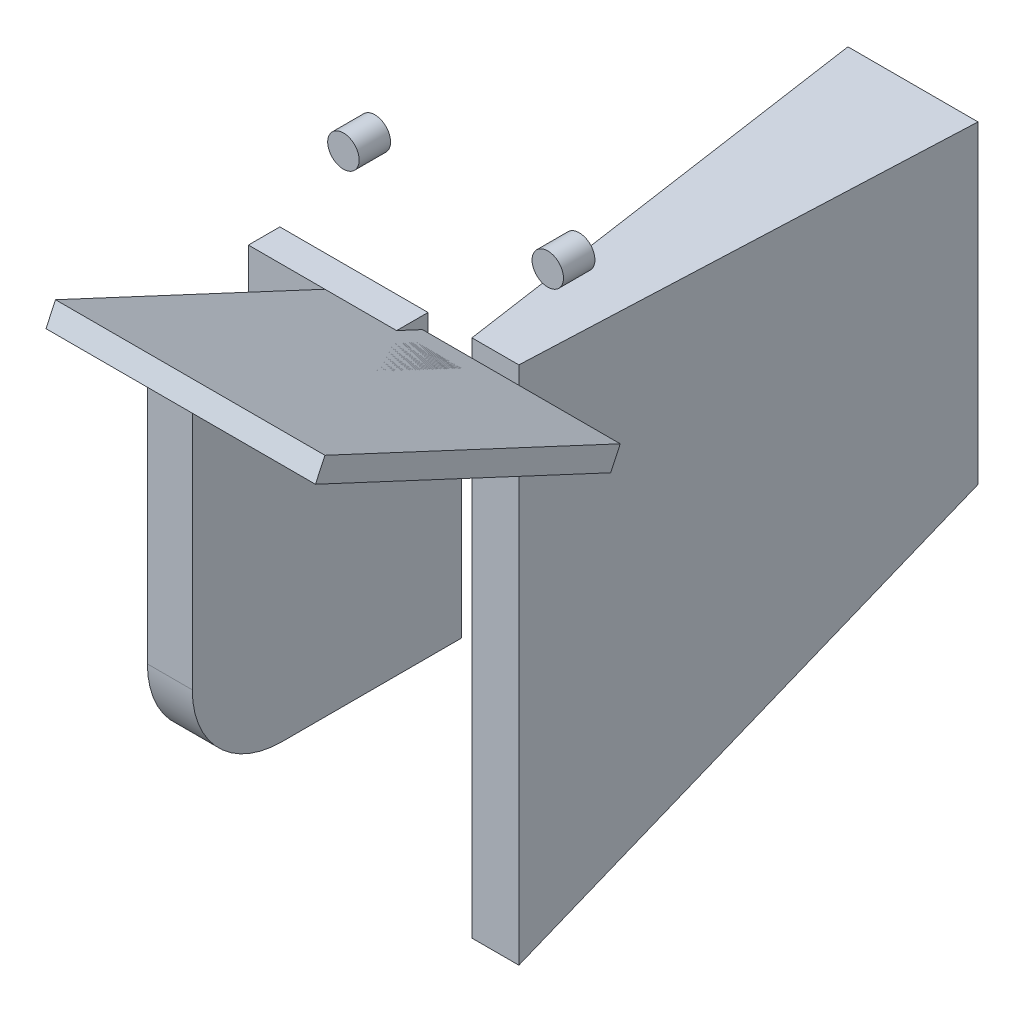
ISO-10303-21;
HEADER;
FILE_DESCRIPTION(('STEP AP214'),'2;1');
FILE_NAME('part.step','',(''),(''),'','','');
FILE_SCHEMA(('AUTOMOTIVE_DESIGN { 1 0 10303 214 1 1 1 1 }'));
ENDSEC;
DATA;
#1=APPLICATION_CONTEXT('core data for automotive mechanical design processes');
#2=APPLICATION_PROTOCOL_DEFINITION('international standard','automotive_design',2000,#1);
#3=PRODUCT_CONTEXT('',#1,'mechanical');
#4=PRODUCT('Part','Part','',(#3));
#5=PRODUCT_RELATED_PRODUCT_CATEGORY('part','',(#4));
#6=PRODUCT_DEFINITION_FORMATION('','',#4);
#7=PRODUCT_DEFINITION_CONTEXT('part definition',#1,'design');
#8=PRODUCT_DEFINITION('design','',#6,#7);
#9=PRODUCT_DEFINITION_SHAPE('','',#8);
#10=(LENGTH_UNIT() NAMED_UNIT(*) SI_UNIT(.MILLI.,.METRE.));
#11=(NAMED_UNIT(*) PLANE_ANGLE_UNIT() SI_UNIT($,.RADIAN.));
#12=(NAMED_UNIT(*) SI_UNIT($,.STERADIAN.) SOLID_ANGLE_UNIT());
#13=UNCERTAINTY_MEASURE_WITH_UNIT(LENGTH_MEASURE(1.E-05),#10,'distance_accuracy_value','');
#14=(GEOMETRIC_REPRESENTATION_CONTEXT(3) GLOBAL_UNCERTAINTY_ASSIGNED_CONTEXT((#13)) GLOBAL_UNIT_ASSIGNED_CONTEXT((#10,
#11,#12)) REPRESENTATION_CONTEXT('',''));
#15=CARTESIAN_POINT('',(0.,0.,0.));
#16=DIRECTION('',(0.,0.,1.));
#17=DIRECTION('',(1.,0.,0.));
#18=AXIS2_PLACEMENT_3D('',#15,#16,#17);
#19=CARTESIAN_POINT('',(29.5000000004554,6.49544339756053,7.));
#20=DIRECTION('',(0.,0.,1.));
#21=DIRECTION('',(0.,-1.,0.));
#22=AXIS2_PLACEMENT_3D('',#19,#20,#21);
#23=PLANE('',#22);
#24=DIRECTION('',(0.,-1.,0.));
#25=VECTOR('',#24,1.);
#26=CARTESIAN_POINT('',(39.5000000004554,6.49544339756053,7.));
#27=LINE('',#26,#25);
#28=CARTESIAN_POINT('',(39.5000000004554,6.49544339756053,7.));
#29=VERTEX_POINT('',#28);
#30=CARTESIAN_POINT('',(39.5000000004554,-45.5260971131392,7.));
#31=VERTEX_POINT('',#30);
#32=EDGE_CURVE('E114',#29,#31,#27,.T.);
#33=ORIENTED_EDGE('',*,*,#32,.T.);
#34=DIRECTION('',(1.,0.,0.));
#35=VECTOR('',#34,1.);
#36=CARTESIAN_POINT('',(29.5000000004554,-45.5260971131392,7.));
#37=LINE('',#36,#35);
#38=CARTESIAN_POINT('',(29.5000000004554,-45.5260971131392,7.));
#39=VERTEX_POINT('',#38);
#40=EDGE_CURVE('E97',#39,#31,#37,.T.);
#41=ORIENTED_EDGE('',*,*,#40,.F.);
#42=DIRECTION('',(0.,-1.,0.));
#43=VECTOR('',#42,1.);
#44=CARTESIAN_POINT('',(29.5000000004554,6.49544339756053,7.));
#45=LINE('',#44,#43);
#46=CARTESIAN_POINT('',(29.5000000004554,6.49544339756053,7.));
#47=VERTEX_POINT('',#46);
#48=EDGE_CURVE('E102',#47,#39,#45,.T.);
#49=ORIENTED_EDGE('',*,*,#48,.F.);
#50=DIRECTION('',(1.,0.,0.));
#51=VECTOR('',#50,1.);
#52=CARTESIAN_POINT('',(29.5000000004554,6.49544339756053,7.));
#53=LINE('',#52,#51);
#54=EDGE_CURVE('E121',#47,#29,#53,.T.);
#55=ORIENTED_EDGE('',*,*,#54,.T.);
#56=EDGE_LOOP('',(#33,#41,#49,#55));
#57=FACE_BOUND('',#56,.T.);
#58=ADVANCED_FACE('F50',(#57),#23,.F.);
#59=CARTESIAN_POINT('',(29.5000000004554,-45.5260971131392,67.));
#60=DIRECTION('',(0.,1.,0.));
#61=DIRECTION('',(0.,0.,1.));
#62=AXIS2_PLACEMENT_3D('',#59,#60,#61);
#63=PLANE('',#62);
#64=DIRECTION('',(0.,0.,1.));
#65=VECTOR('',#64,1.);
#66=CARTESIAN_POINT('',(39.5000000004554,-45.5260971131392,67.));
#67=LINE('',#66,#65);
#68=CARTESIAN_POINT('',(39.5000000004554,-45.5260971131392,47.));
#69=VERTEX_POINT('',#68);
#70=EDGE_CURVE('E129',#31,#69,#67,.T.);
#71=ORIENTED_EDGE('',*,*,#70,.T.);
#72=DIRECTION('',(1.,0.,0.));
#73=VECTOR('',#72,1.);
#74=CARTESIAN_POINT('',(29.5000000004554,-45.5260971131392,47.));
#75=LINE('',#74,#73);
#76=CARTESIAN_POINT('',(29.5000000004554,-45.5260971131392,47.));
#77=VERTEX_POINT('',#76);
#78=EDGE_CURVE('E58',#69,#77,#75,.F.);
#79=ORIENTED_EDGE('',*,*,#78,.T.);
#80=DIRECTION('',(0.,0.,1.));
#81=VECTOR('',#80,1.);
#82=CARTESIAN_POINT('',(29.5000000004554,-45.5260971131392,67.));
#83=LINE('',#82,#81);
#84=EDGE_CURVE('E93',#39,#77,#83,.T.);
#85=ORIENTED_EDGE('',*,*,#84,.F.);
#86=ORIENTED_EDGE('',*,*,#40,.T.);
#87=EDGE_LOOP('',(#71,#79,#85,#86));
#88=FACE_BOUND('',#87,.T.);
#89=ADVANCED_FACE('F95',(#88),#63,.F.);
#90=CARTESIAN_POINT('',(29.5000000004554,34.4739028868608,67.));
#91=DIRECTION('',(0.,0.,-1.));
#92=DIRECTION('',(0.,1.,0.));
#93=AXIS2_PLACEMENT_3D('',#90,#91,#92);
#94=PLANE('',#93);
#95=DIRECTION('',(0.,1.,0.));
#96=VECTOR('',#95,1.);
#97=CARTESIAN_POINT('',(29.5000000004554,34.4739028868608,67.));
#98=LINE('',#97,#96);
#99=CARTESIAN_POINT('',(29.5000000004554,-25.5260971131392,67.));
#100=VERTEX_POINT('',#99);
#101=CARTESIAN_POINT('',(29.5000000004554,34.4739028868608,67.));
#102=VERTEX_POINT('',#101);
#103=EDGE_CURVE('E101',#100,#102,#98,.T.);
#104=ORIENTED_EDGE('',*,*,#103,.F.);
#105=DIRECTION('',(1.,0.,0.));
#106=VECTOR('',#105,1.);
#107=CARTESIAN_POINT('',(29.5000000004554,-25.5260971131392,67.));
#108=LINE('',#107,#106);
#109=CARTESIAN_POINT('',(39.5000000004554,-25.5260971131392,67.));
#110=VERTEX_POINT('',#109);
#111=EDGE_CURVE('E115',#100,#110,#108,.T.);
#112=ORIENTED_EDGE('',*,*,#111,.T.);
#113=DIRECTION('',(0.,1.,0.));
#114=VECTOR('',#113,1.);
#115=CARTESIAN_POINT('',(39.5000000004554,34.4739028868608,67.));
#116=LINE('',#115,#114);
#117=CARTESIAN_POINT('',(39.5000000004554,34.4739028868608,67.));
#118=VERTEX_POINT('',#117);
#119=EDGE_CURVE('E127',#110,#118,#116,.T.);
#120=ORIENTED_EDGE('',*,*,#119,.T.);
#121=DIRECTION('',(1.,0.,0.));
#122=VECTOR('',#121,1.);
#123=CARTESIAN_POINT('',(29.5000000004554,34.4739028868608,67.));
#124=LINE('',#123,#122);
#125=EDGE_CURVE('E116',#102,#118,#124,.T.);
#126=ORIENTED_EDGE('',*,*,#125,.F.);
#127=EDGE_LOOP('',(#104,#112,#120,#126));
#128=FACE_BOUND('',#127,.T.);
#129=ADVANCED_FACE('F137',(#128),#94,.F.);
#130=CARTESIAN_POINT('',(29.5000000004554,6.49544339756053,7.));
#131=DIRECTION('',(0.,-0.906307787036648,0.422618261740704));
#132=DIRECTION('',(0.,-0.422618261740704,-0.906307787036648));
#133=AXIS2_PLACEMENT_3D('',#130,#131,#132);
#134=PLANE('',#133);
#135=DIRECTION('',(0.,-0.422618261740704,-0.906307787036648));
#136=VECTOR('',#135,1.);
#137=CARTESIAN_POINT('',(39.5000000004554,6.49544339756053,7.));
#138=LINE('',#137,#136);
#139=EDGE_CURVE('E111',#118,#29,#138,.T.);
#140=ORIENTED_EDGE('',*,*,#139,.T.);
#141=ORIENTED_EDGE('',*,*,#54,.F.);
#142=DIRECTION('',(0.,-0.422618261740704,-0.906307787036648));
#143=VECTOR('',#142,1.);
#144=CARTESIAN_POINT('',(29.5000000004554,6.49544339756053,7.));
#145=LINE('',#144,#143);
#146=EDGE_CURVE('E107',#102,#47,#145,.T.);
#147=ORIENTED_EDGE('',*,*,#146,.F.);
#148=ORIENTED_EDGE('',*,*,#125,.T.);
#149=EDGE_LOOP('',(#140,#141,#147,#148));
#150=FACE_BOUND('',#149,.T.);
#151=ADVANCED_FACE('F140',(#150),#134,.F.);
#152=CARTESIAN_POINT('',(29.5000000004554,0.,0.));
#153=DIRECTION('',(1.,0.,0.));
#154=DIRECTION('',(0.,0.,-1.));
#155=AXIS2_PLACEMENT_3D('',#152,#153,#154);
#156=PLANE('',#155);
#157=ORIENTED_EDGE('',*,*,#84,.T.);
#158=CARTESIAN_POINT('',(29.5000000004554,-25.5260971131392,47.));
#159=DIRECTION('',(1.,0.,0.));
#160=DIRECTION('',(0.,0.,-1.));
#161=AXIS2_PLACEMENT_3D('',#158,#159,#160);
#162=CIRCLE('',#161,20.);
#163=EDGE_CURVE('E12',#77,#100,#162,.F.);
#164=ORIENTED_EDGE('',*,*,#163,.T.);
#165=ORIENTED_EDGE('',*,*,#103,.T.);
#166=ORIENTED_EDGE('',*,*,#146,.T.);
#167=ORIENTED_EDGE('',*,*,#48,.T.);
#168=EDGE_LOOP('',(#157,#164,#165,#166,#167));
#169=FACE_BOUND('',#168,.T.);
#170=ADVANCED_FACE('F105',(#169),#156,.F.);
#171=CARTESIAN_POINT('',(39.5000000004554,0.,0.));
#172=DIRECTION('',(1.,0.,0.));
#173=DIRECTION('',(0.,0.,-1.));
#174=AXIS2_PLACEMENT_3D('',#171,#172,#173);
#175=PLANE('',#174);
#176=ORIENTED_EDGE('',*,*,#119,.F.);
#177=CARTESIAN_POINT('',(39.5000000004554,-25.5260971131392,47.));
#178=DIRECTION('',(1.,0.,0.));
#179=DIRECTION('',(0.,0.,-1.));
#180=AXIS2_PLACEMENT_3D('',#177,#178,#179);
#181=CIRCLE('',#180,20.);
#182=EDGE_CURVE('E72',#110,#69,#181,.T.);
#183=ORIENTED_EDGE('',*,*,#182,.T.);
#184=ORIENTED_EDGE('',*,*,#70,.F.);
#185=ORIENTED_EDGE('',*,*,#32,.F.);
#186=ORIENTED_EDGE('',*,*,#139,.F.);
#187=EDGE_LOOP('',(#176,#183,#184,#185,#186));
#188=FACE_BOUND('',#187,.T.);
#189=ADVANCED_FACE('F141',(#188),#175,.T.);
#190=CARTESIAN_POINT('',(29.5000000004554,-25.5260971131392,47.));
#191=DIRECTION('',(1.,0.,0.));
#192=DIRECTION('',(0.,0.,-1.));
#193=AXIS2_PLACEMENT_3D('',#190,#191,#192);
#194=CYLINDRICAL_SURFACE('',#193,20.);
#195=ORIENTED_EDGE('',*,*,#163,.F.);
#196=ORIENTED_EDGE('',*,*,#78,.F.);
#197=ORIENTED_EDGE('',*,*,#182,.F.);
#198=ORIENTED_EDGE('',*,*,#111,.F.);
#199=EDGE_LOOP('',(#195,#196,#197,#198));
#200=FACE_BOUND('',#199,.T.);
#201=ADVANCED_FACE('F52',(#200),#194,.T.);
#202=CLOSED_SHELL('',(#58,#89,#129,#151,#170,#189,#201));
#203=MANIFOLD_SOLID_BREP('B2',#202);
#204=CARTESIAN_POINT('',(0.,-193.834238180492,-97.9796701991949));
#205=DIRECTION('',(0.,0.,1.));
#206=DIRECTION('',(1.,0.,0.));
#207=AXIS2_PLACEMENT_3D('',#204,#205,#206);
#208=PLANE('',#207);
#209=DIRECTION('',(0.,1.,0.));
#210=VECTOR('',#209,1.);
#211=CARTESIAN_POINT('',(49.4812615912494,-193.834238180492,-97.9796701991949));
#212=LINE('',#211,#210);
#213=CARTESIAN_POINT('',(49.4812615912494,-63.4225780339153,-97.9796701991949));
#214=VERTEX_POINT('',#213);
#215=CARTESIAN_POINT('',(49.4812615912494,6.49544339756053,-97.9796701991949));
#216=VERTEX_POINT('',#215);
#217=EDGE_CURVE('E284',#214,#216,#212,.T.);
#218=ORIENTED_EDGE('',*,*,#217,.F.);
#219=DIRECTION('',(-1.,0.,0.));
#220=VECTOR('',#219,1.);
#221=CARTESIAN_POINT('',(3.08269763028648E-13,-63.4225780339152,-97.9796701991949));
#222=LINE('',#221,#220);
#223=CARTESIAN_POINT('',(20.5187384096205,-63.4225780339152,-97.9796701991949));
#224=VERTEX_POINT('',#223);
#225=EDGE_CURVE('E229',#214,#224,#222,.T.);
#226=ORIENTED_EDGE('',*,*,#225,.T.);
#227=DIRECTION('',(0.,1.,0.));
#228=VECTOR('',#227,1.);
#229=CARTESIAN_POINT('',(20.5187384096205,-193.834238180492,-97.9796701991949));
#230=LINE('',#229,#228);
#231=CARTESIAN_POINT('',(20.5187384096205,6.49544339756053,-97.9796701991949));
#232=VERTEX_POINT('',#231);
#233=EDGE_CURVE('E259',#224,#232,#230,.T.);
#234=ORIENTED_EDGE('',*,*,#233,.T.);
#235=DIRECTION('',(1.,0.,0.));
#236=VECTOR('',#235,1.);
#237=CARTESIAN_POINT('',(0.,6.49544339756053,-97.9796701991949));
#238=LINE('',#237,#236);
#239=EDGE_CURVE('E262',#232,#216,#238,.T.);
#240=ORIENTED_EDGE('',*,*,#239,.T.);
#241=EDGE_LOOP('',(#218,#226,#234,#240));
#242=FACE_BOUND('',#241,.T.);
#243=ADVANCED_FACE('F222',(#242),#208,.F.);
#244=CARTESIAN_POINT('',(45.133983709623,-193.834238180492,1.96322086544044));
#245=DIRECTION('',(-0.999055318855758,0.,-0.0434565284625806));
#246=DIRECTION('',(-0.0434565284625806,0.,0.999055318855758));
#247=AXIS2_PLACEMENT_3D('',#244,#245,#246);
#248=PLANE('',#247);
#249=DIRECTION('',(0.,1.,0.));
#250=VECTOR('',#249,1.);
#251=CARTESIAN_POINT('',(45.2193791444974,-193.834238180492,0.));
#252=LINE('',#251,#250);
#253=CARTESIAN_POINT('',(45.2193791444974,-109.271615746902,0.));
#254=VERTEX_POINT('',#253);
#255=CARTESIAN_POINT('',(45.2193791444974,6.49544339756053,0.));
#256=VERTEX_POINT('',#255);
#257=EDGE_CURVE('E287',#254,#256,#252,.T.);
#258=ORIENTED_EDGE('',*,*,#257,.F.);
#259=DIRECTION('',(0.0393669572988325,0.423507014186949,-0.905037044328842));
#260=VECTOR('',#259,1.);
#261=CARTESIAN_POINT('',(43.7394566027982,-125.192520481939,34.0230694693485));
#262=LINE('',#261,#260);
#263=EDGE_CURVE('E236',#254,#214,#262,.T.);
#264=ORIENTED_EDGE('',*,*,#263,.T.);
#265=ORIENTED_EDGE('',*,*,#217,.T.);
#266=DIRECTION('',(-0.0434565284625806,0.,0.999055318855758));
#267=VECTOR('',#266,1.);
#268=CARTESIAN_POINT('',(45.133983709623,6.49544339756053,1.96322086544044));
#269=LINE('',#268,#267);
#270=EDGE_CURVE('E266',#216,#256,#269,.T.);
#271=ORIENTED_EDGE('',*,*,#270,.T.);
#272=EDGE_LOOP('',(#258,#264,#265,#271));
#273=FACE_BOUND('',#272,.T.);
#274=ADVANCED_FACE('F293',(#273),#248,.F.);
#275=CARTESIAN_POINT('',(0.,-193.834238180492,4.57744585818362E-13));
#276=DIRECTION('',(0.,0.,-1.));
#277=DIRECTION('',(-1.,0.,0.));
#278=AXIS2_PLACEMENT_3D('',#275,#276,#277);
#279=PLANE('',#278);
#280=DIRECTION('',(0.,1.,0.));
#281=VECTOR('',#280,1.);
#282=CARTESIAN_POINT('',(34.7806208555029,-193.834238180492,0.));
#283=LINE('',#282,#281);
#284=CARTESIAN_POINT('',(34.7806208555029,-109.271615746902,0.));
#285=VERTEX_POINT('',#284);
#286=CARTESIAN_POINT('',(34.7806208555029,6.49544339756053,0.));
#287=VERTEX_POINT('',#286);
#288=EDGE_CURVE('E265',#285,#287,#283,.T.);
#289=ORIENTED_EDGE('',*,*,#288,.F.);
#290=DIRECTION('',(1.,0.,0.));
#291=VECTOR('',#290,1.);
#292=CARTESIAN_POINT('',(-1.08585697845071E-13,-109.271615746902,4.57744585818363E-13));
#293=LINE('',#292,#291);
#294=EDGE_CURVE('E286',#285,#254,#293,.T.);
#295=ORIENTED_EDGE('',*,*,#294,.T.);
#296=ORIENTED_EDGE('',*,*,#257,.T.);
#297=DIRECTION('',(-1.,0.,0.));
#298=VECTOR('',#297,1.);
#299=CARTESIAN_POINT('',(0.,6.49544339756053,4.57744585818362E-13));
#300=LINE('',#299,#298);
#301=EDGE_CURVE('E278',#256,#287,#300,.T.);
#302=ORIENTED_EDGE('',*,*,#301,.T.);
#303=EDGE_LOOP('',(#289,#295,#296,#302));
#304=FACE_BOUND('',#303,.T.);
#305=ADVANCED_FACE('F291',(#304),#279,.F.);
#306=CARTESIAN_POINT('',(34.0589925564434,-193.834238180492,-4.95761362614967));
#307=DIRECTION('',(-0.989571624818279,0.,0.144041658399613));
#308=DIRECTION('',(0.144041658399613,0.,0.989571624818279));
#309=AXIS2_PLACEMENT_3D('',#306,#307,#308);
#310=PLANE('',#309);
#311=DIRECTION('',(-0.130707978099501,0.420199440011685,-0.897968738361758));
#312=VECTOR('',#311,1.);
#313=CARTESIAN_POINT('',(38.8308770719889,-122.292361831549,27.8254129368531));
#314=LINE('',#313,#312);
#315=EDGE_CURVE('E48',#285,#224,#314,.T.);
#316=ORIENTED_EDGE('',*,*,#315,.F.);
#317=ORIENTED_EDGE('',*,*,#288,.T.);
#318=DIRECTION('',(0.144041658399613,0.,0.989571624818279));
#319=VECTOR('',#318,1.);
#320=CARTESIAN_POINT('',(34.0589925564434,6.49544339756053,-4.95761362614967));
#321=LINE('',#320,#319);
#322=EDGE_CURVE('E272',#232,#287,#321,.T.);
#323=ORIENTED_EDGE('',*,*,#322,.F.);
#324=ORIENTED_EDGE('',*,*,#233,.F.);
#325=EDGE_LOOP('',(#316,#317,#323,#324));
#326=FACE_BOUND('',#325,.T.);
#327=ADVANCED_FACE('F275',(#326),#310,.T.);
#328=CARTESIAN_POINT('',(0.,6.49544339756053,0.));
#329=DIRECTION('',(0.,1.,0.));
#330=DIRECTION('',(0.,0.,1.));
#331=AXIS2_PLACEMENT_3D('',#328,#329,#330);
#332=PLANE('',#331);
#333=ORIENTED_EDGE('',*,*,#239,.F.);
#334=ORIENTED_EDGE('',*,*,#322,.T.);
#335=ORIENTED_EDGE('',*,*,#301,.F.);
#336=ORIENTED_EDGE('',*,*,#270,.F.);
#337=EDGE_LOOP('',(#333,#334,#335,#336));
#338=FACE_BOUND('',#337,.T.);
#339=ADVANCED_FACE('F270',(#338),#332,.T.);
#340=CARTESIAN_POINT('',(-4.99999999956517,16.5974489689036,-268.982950663816));
#341=DIRECTION('',(0.,0.905739154404806,0.423835562663241));
#342=DIRECTION('',(0.,-0.423835562663241,0.905739154404806));
#343=AXIS2_PLACEMENT_3D('',#340,#341,#342);
#344=PLANE('',#343);
#345=ORIENTED_EDGE('',*,*,#263,.F.);
#346=ORIENTED_EDGE('',*,*,#294,.F.);
#347=ORIENTED_EDGE('',*,*,#315,.T.);
#348=ORIENTED_EDGE('',*,*,#225,.F.);
#349=EDGE_LOOP('',(#345,#346,#347,#348));
#350=FACE_BOUND('',#349,.T.);
#351=ADVANCED_FACE('F309',(#350),#344,.F.);
#352=CLOSED_SHELL('',(#243,#274,#305,#327,#339,#351));
#353=MANIFOLD_SOLID_BREP('B6',#352);
#354=CARTESIAN_POINT('',(58.6604137531901,35.1985420606941,7.));
#355=DIRECTION('',(0.,0.,-1.));
#356=DIRECTION('',(-1.,0.,0.));
#357=AXIS2_PLACEMENT_3D('',#354,#355,#356);
#358=CYLINDRICAL_SURFACE('',#357,3.50000000000001);
#359=CARTESIAN_POINT('',(58.6604137531901,35.1985420606941,7.));
#360=DIRECTION('',(0.,0.,1.));
#361=DIRECTION('',(1.,0.,0.));
#362=AXIS2_PLACEMENT_3D('',#359,#360,#361);
#363=CIRCLE('',#362,3.50000000000001);
#364=CARTESIAN_POINT('',(62.1604137531902,35.1985420606941,7.));
#365=VERTEX_POINT('',#364);
#366=EDGE_CURVE('E373',#365,#365,#363,.T.);
#367=ORIENTED_EDGE('',*,*,#366,.F.);
#368=EDGE_LOOP('',(#367));
#369=FACE_BOUND('',#368,.T.);
#370=CARTESIAN_POINT('',(58.6604137531901,35.1985420606941,0.));
#371=DIRECTION('',(0.,0.,1.));
#372=DIRECTION('',(1.,0.,0.));
#373=AXIS2_PLACEMENT_3D('',#370,#371,#372);
#374=CIRCLE('',#373,3.50000000000001);
#375=CARTESIAN_POINT('',(62.1604137531902,35.1985420606941,0.));
#376=VERTEX_POINT('',#375);
#377=EDGE_CURVE('E221',#376,#376,#374,.T.);
#378=ORIENTED_EDGE('',*,*,#377,.T.);
#379=EDGE_LOOP('',(#378));
#380=FACE_BOUND('',#379,.T.);
#381=ADVANCED_FACE('F369',(#369,#380),#358,.T.);
#382=CARTESIAN_POINT('',(58.6604137531901,35.1985420606941,7.));
#383=DIRECTION('',(0.,0.,1.));
#384=DIRECTION('',(1.,0.,0.));
#385=AXIS2_PLACEMENT_3D('',#382,#383,#384);
#386=PLANE('',#385);
#387=ORIENTED_EDGE('',*,*,#366,.T.);
#388=EDGE_LOOP('',(#387));
#389=FACE_BOUND('',#388,.T.);
#390=ADVANCED_FACE('F371',(#389),#386,.T.);
#391=CARTESIAN_POINT('',(58.6604137531901,35.1985420606941,0.));
#392=DIRECTION('',(0.,0.,1.));
#393=DIRECTION('',(1.,0.,0.));
#394=AXIS2_PLACEMENT_3D('',#391,#392,#393);
#395=PLANE('',#394);
#396=ORIENTED_EDGE('',*,*,#377,.F.);
#397=EDGE_LOOP('',(#396));
#398=FACE_BOUND('',#397,.T.);
#399=ADVANCED_FACE('F388',(#398),#395,.F.);
#400=CLOSED_SHELL('',(#381,#390,#399));
#401=MANIFOLD_SOLID_BREP('B42',#400);
#402=CARTESIAN_POINT('',(13.1581918962194,35.1985420606941,7.));
#403=DIRECTION('',(0.,0.,-1.));
#404=DIRECTION('',(-1.,0.,0.));
#405=AXIS2_PLACEMENT_3D('',#402,#403,#404);
#406=CYLINDRICAL_SURFACE('',#405,3.5);
#407=CARTESIAN_POINT('',(13.1581918962194,35.1985420606941,7.));
#408=DIRECTION('',(0.,0.,1.));
#409=DIRECTION('',(1.,0.,0.));
#410=AXIS2_PLACEMENT_3D('',#407,#408,#409);
#411=CIRCLE('',#410,3.5);
#412=CARTESIAN_POINT('',(16.6581918962194,35.1985420606941,7.));
#413=VERTEX_POINT('',#412);
#414=EDGE_CURVE('E429',#413,#413,#411,.T.);
#415=ORIENTED_EDGE('',*,*,#414,.F.);
#416=EDGE_LOOP('',(#415));
#417=FACE_BOUND('',#416,.T.);
#418=CARTESIAN_POINT('',(13.1581918962194,35.1985420606941,0.));
#419=DIRECTION('',(0.,0.,1.));
#420=DIRECTION('',(1.,0.,0.));
#421=AXIS2_PLACEMENT_3D('',#418,#419,#420);
#422=CIRCLE('',#421,3.5);
#423=CARTESIAN_POINT('',(16.6581918962194,35.1985420606941,0.));
#424=VERTEX_POINT('',#423);
#425=EDGE_CURVE('E368',#424,#424,#422,.T.);
#426=ORIENTED_EDGE('',*,*,#425,.T.);
#427=EDGE_LOOP('',(#426));
#428=FACE_BOUND('',#427,.T.);
#429=ADVANCED_FACE('F425',(#417,#428),#406,.T.);
#430=CARTESIAN_POINT('',(13.1581918962194,35.1985420606941,7.));
#431=DIRECTION('',(0.,0.,1.));
#432=DIRECTION('',(1.,0.,0.));
#433=AXIS2_PLACEMENT_3D('',#430,#431,#432);
#434=PLANE('',#433);
#435=ORIENTED_EDGE('',*,*,#414,.T.);
#436=EDGE_LOOP('',(#435));
#437=FACE_BOUND('',#436,.T.);
#438=ADVANCED_FACE('F427',(#437),#434,.T.);
#439=CARTESIAN_POINT('',(13.1581918962194,35.1985420606941,0.));
#440=DIRECTION('',(0.,0.,1.));
#441=DIRECTION('',(1.,0.,0.));
#442=AXIS2_PLACEMENT_3D('',#439,#440,#441);
#443=PLANE('',#442);
#444=ORIENTED_EDGE('',*,*,#425,.F.);
#445=EDGE_LOOP('',(#444));
#446=FACE_BOUND('',#445,.T.);
#447=ADVANCED_FACE('F444',(#446),#443,.F.);
#448=CLOSED_SHELL('',(#429,#438,#447));
#449=MANIFOLD_SOLID_BREP('B216',#448);
#450=CARTESIAN_POINT('',(25.0000000004552,6.49544339756053,7.));
#451=DIRECTION('',(-1.,0.,0.));
#452=DIRECTION('',(0.,0.,1.));
#453=AXIS2_PLACEMENT_3D('',#450,#451,#452);
#454=PLANE('',#453);
#455=DIRECTION('',(0.,-0.422618261740704,-0.906307787036648));
#456=VECTOR('',#455,1.);
#457=CARTESIAN_POINT('',(25.0000000004552,1.96390446237729,9.11309130870352));
#458=LINE('',#457,#456);
#459=CARTESIAN_POINT('',(25.0000000004552,0.978553802748059,7.));
#460=VERTEX_POINT('',#459);
#461=CARTESIAN_POINT('',(25.0000000004552,-0.717251088539166,3.36333467480066));
#462=VERTEX_POINT('',#461);
#463=EDGE_CURVE('E584',#460,#462,#458,.T.);
#464=ORIENTED_EDGE('',*,*,#463,.F.);
#465=DIRECTION('',(0.,1.,0.));
#466=VECTOR('',#465,1.);
#467=CARTESIAN_POINT('',(25.0000000004552,6.49544339756053,7.));
#468=LINE('',#467,#466);
#469=CARTESIAN_POINT('',(25.0000000004552,-38.7915143226798,7.));
#470=VERTEX_POINT('',#469);
#471=EDGE_CURVE('E593',#470,#460,#468,.T.);
#472=ORIENTED_EDGE('',*,*,#471,.F.);
#473=DIRECTION('',(0.,0.,-1.));
#474=VECTOR('',#473,1.);
#475=CARTESIAN_POINT('',(25.0000000004552,-38.7915143226798,7.));
#476=LINE('',#475,#474);
#477=CARTESIAN_POINT('',(25.0000000004552,-38.7915143226798,0.));
#478=VERTEX_POINT('',#477);
#479=EDGE_CURVE('E613',#470,#478,#476,.T.);
#480=ORIENTED_EDGE('',*,*,#479,.T.);
#481=DIRECTION('',(0.,1.,0.));
#482=VECTOR('',#481,1.);
#483=CARTESIAN_POINT('',(25.0000000004552,6.49544339756053,0.));
#484=LINE('',#483,#482);
#485=CARTESIAN_POINT('',(25.0000000004552,6.49544339756053,0.));
#486=VERTEX_POINT('',#485);
#487=EDGE_CURVE('E605',#478,#486,#484,.T.);
#488=ORIENTED_EDGE('',*,*,#487,.T.);
#489=DIRECTION('',(0.,0.,-1.));
#490=VECTOR('',#489,1.);
#491=CARTESIAN_POINT('',(25.0000000004552,6.49544339756053,7.));
#492=LINE('',#491,#490);
#493=CARTESIAN_POINT('',(25.0000000004552,6.49544339756053,7.));
#494=VERTEX_POINT('',#493);
#495=EDGE_CURVE('E610',#494,#486,#492,.T.);
#496=ORIENTED_EDGE('',*,*,#495,.F.);
#497=DIRECTION('',(0.,-0.422618261740704,-0.906307787036648));
#498=VECTOR('',#497,1.);
#499=CARTESIAN_POINT('',(25.0000000004552,6.49544339756053,7.));
#500=LINE('',#499,#498);
#501=CARTESIAN_POINT('',(25.0000000004552,3.81428784664409,1.25024336609714));
#502=VERTEX_POINT('',#501);
#503=EDGE_CURVE('E490',#494,#502,#500,.T.);
#504=ORIENTED_EDGE('',*,*,#503,.T.);
#505=DIRECTION('',(0.,-0.906307787036648,0.422618261740704));
#506=VECTOR('',#505,1.);
#507=CARTESIAN_POINT('',(25.0000000004552,3.81428784664409,1.25024336609714));
#508=LINE('',#507,#506);
#509=EDGE_CURVE('E423',#502,#462,#508,.T.);
#510=ORIENTED_EDGE('',*,*,#509,.T.);
#511=EDGE_LOOP('',(#464,#472,#480,#488,#496,#504,#510));
#512=FACE_BOUND('',#511,.T.);
#513=ADVANCED_FACE('F472',(#512),#454,.F.);
#514=CARTESIAN_POINT('',(0.,0.,7.));
#515=DIRECTION('',(0.,0.,1.));
#516=DIRECTION('',(1.,0.,0.));
#517=AXIS2_PLACEMENT_3D('',#514,#515,#516);
#518=PLANE('',#517);
#519=DIRECTION('',(-1.,0.,0.));
#520=VECTOR('',#519,1.);
#521=CARTESIAN_POINT('',(0.,0.978553802748059,7.));
#522=LINE('',#521,#520);
#523=CARTESIAN_POINT('',(9.04395399322312,0.978553802748059,7.));
#524=VERTEX_POINT('',#523);
#525=EDGE_CURVE('E619',#460,#524,#522,.T.);
#526=ORIENTED_EDGE('',*,*,#525,.T.);
#527=DIRECTION('',(0.,1.,0.));
#528=VECTOR('',#527,1.);
#529=CARTESIAN_POINT('',(9.04395399322312,0.,7.));
#530=LINE('',#529,#528);
#531=CARTESIAN_POINT('',(9.04395399322312,6.49544339756053,7.));
#532=VERTEX_POINT('',#531);
#533=EDGE_CURVE('E480',#524,#532,#530,.T.);
#534=ORIENTED_EDGE('',*,*,#533,.T.);
#535=DIRECTION('',(-1.,0.,0.));
#536=VECTOR('',#535,1.);
#537=CARTESIAN_POINT('',(-7.9999999995446,6.49544339756053,7.));
#538=LINE('',#537,#536);
#539=CARTESIAN_POINT('',(-7.9999999995446,6.49544339756053,7.));
#540=VERTEX_POINT('',#539);
#541=EDGE_CURVE('E596',#532,#540,#538,.T.);
#542=ORIENTED_EDGE('',*,*,#541,.T.);
#543=DIRECTION('',(0.,-1.,0.));
#544=VECTOR('',#543,1.);
#545=CARTESIAN_POINT('',(-7.9999999995446,6.49544339756053,7.));
#546=LINE('',#545,#544);
#547=CARTESIAN_POINT('',(-7.99999999954458,-38.7915143226799,7.));
#548=VERTEX_POINT('',#547);
#549=EDGE_CURVE('E587',#540,#548,#546,.T.);
#550=ORIENTED_EDGE('',*,*,#549,.T.);
#551=DIRECTION('',(1.,0.,0.));
#552=VECTOR('',#551,1.);
#553=CARTESIAN_POINT('',(-7.99999999954458,-38.7915143226799,7.));
#554=LINE('',#553,#552);
#555=EDGE_CURVE('E590',#548,#470,#554,.T.);
#556=ORIENTED_EDGE('',*,*,#555,.T.);
#557=ORIENTED_EDGE('',*,*,#471,.T.);
#558=EDGE_LOOP('',(#526,#534,#542,#550,#556,#557));
#559=FACE_BOUND('',#558,.T.);
#560=ADVANCED_FACE('F623',(#559),#518,.T.);
#561=CARTESIAN_POINT('',(-7.9999999995446,6.49544339756053,7.));
#562=DIRECTION('',(1.,0.,0.));
#563=DIRECTION('',(0.,1.,0.));
#564=AXIS2_PLACEMENT_3D('',#561,#562,#563);
#565=PLANE('',#564);
#566=DIRECTION('',(0.,-1.,0.));
#567=VECTOR('',#566,1.);
#568=CARTESIAN_POINT('',(-7.9999999995446,6.49544339756053,0.));
#569=LINE('',#568,#567);
#570=CARTESIAN_POINT('',(-7.9999999995446,6.49544339756053,0.));
#571=VERTEX_POINT('',#570);
#572=CARTESIAN_POINT('',(-7.99999999954458,-38.7915143226799,0.));
#573=VERTEX_POINT('',#572);
#574=EDGE_CURVE('E586',#571,#573,#569,.T.);
#575=ORIENTED_EDGE('',*,*,#574,.T.);
#576=DIRECTION('',(0.,0.,-1.));
#577=VECTOR('',#576,1.);
#578=CARTESIAN_POINT('',(-7.99999999954458,-38.7915143226799,7.));
#579=LINE('',#578,#577);
#580=EDGE_CURVE('E616',#548,#573,#579,.T.);
#581=ORIENTED_EDGE('',*,*,#580,.F.);
#582=ORIENTED_EDGE('',*,*,#549,.F.);
#583=DIRECTION('',(0.,0.,-1.));
#584=VECTOR('',#583,1.);
#585=CARTESIAN_POINT('',(-7.9999999995446,6.49544339756053,7.));
#586=LINE('',#585,#584);
#587=EDGE_CURVE('E600',#540,#571,#586,.T.);
#588=ORIENTED_EDGE('',*,*,#587,.T.);
#589=EDGE_LOOP('',(#575,#581,#582,#588));
#590=FACE_BOUND('',#589,.T.);
#591=ADVANCED_FACE('F474',(#590),#565,.F.);
#592=CARTESIAN_POINT('',(-7.99999999954458,-38.7915143226799,7.));
#593=DIRECTION('',(0.,1.,0.));
#594=DIRECTION('',(-1.,0.,0.));
#595=AXIS2_PLACEMENT_3D('',#592,#593,#594);
#596=PLANE('',#595);
#597=DIRECTION('',(1.,0.,0.));
#598=VECTOR('',#597,1.);
#599=CARTESIAN_POINT('',(-7.99999999954458,-38.7915143226799,0.));
#600=LINE('',#599,#598);
#601=EDGE_CURVE('E603',#573,#478,#600,.T.);
#602=ORIENTED_EDGE('',*,*,#601,.T.);
#603=ORIENTED_EDGE('',*,*,#479,.F.);
#604=ORIENTED_EDGE('',*,*,#555,.F.);
#605=ORIENTED_EDGE('',*,*,#580,.T.);
#606=EDGE_LOOP('',(#602,#603,#604,#605));
#607=FACE_BOUND('',#606,.T.);
#608=ADVANCED_FACE('F656',(#607),#596,.F.);
#609=CARTESIAN_POINT('',(-7.9999999995446,6.49544339756053,7.));
#610=DIRECTION('',(0.,-1.,0.));
#611=DIRECTION('',(0.,0.,-1.));
#612=AXIS2_PLACEMENT_3D('',#609,#610,#611);
#613=PLANE('',#612);
#614=DIRECTION('',(-1.,0.,0.));
#615=VECTOR('',#614,1.);
#616=CARTESIAN_POINT('',(-7.9999999995446,6.49544339756053,0.));
#617=LINE('',#616,#615);
#618=EDGE_CURVE('E591',#486,#571,#617,.T.);
#619=ORIENTED_EDGE('',*,*,#618,.T.);
#620=ORIENTED_EDGE('',*,*,#587,.F.);
#621=ORIENTED_EDGE('',*,*,#541,.F.);
#622=EDGE_CURVE('E597',#494,#532,#538,.T.);
#623=ORIENTED_EDGE('',*,*,#622,.F.);
#624=ORIENTED_EDGE('',*,*,#495,.T.);
#625=EDGE_LOOP('',(#619,#620,#621,#623,#624));
#626=FACE_BOUND('',#625,.T.);
#627=ADVANCED_FACE('F644',(#626),#613,.F.);
#628=CARTESIAN_POINT('',(0.,0.,0.));
#629=DIRECTION('',(0.,0.,1.));
#630=DIRECTION('',(1.,0.,0.));
#631=AXIS2_PLACEMENT_3D('',#628,#629,#630);
#632=PLANE('',#631);
#633=ORIENTED_EDGE('',*,*,#574,.F.);
#634=ORIENTED_EDGE('',*,*,#618,.F.);
#635=ORIENTED_EDGE('',*,*,#487,.F.);
#636=ORIENTED_EDGE('',*,*,#601,.F.);
#637=EDGE_LOOP('',(#633,#634,#635,#636));
#638=FACE_BOUND('',#637,.T.);
#639=ADVANCED_FACE('F637',(#638),#632,.F.);
#640=CARTESIAN_POINT('',(0.,-0.717251088539152,3.36333467480066));
#641=DIRECTION('',(0.,-0.422618261740704,-0.906307787036648));
#642=DIRECTION('',(0.,0.906307787036648,-0.422618261740704));
#643=AXIS2_PLACEMENT_3D('',#640,#641,#642);
#644=PLANE('',#643);
#645=ORIENTED_EDGE('',*,*,#509,.F.);
#646=DIRECTION('',(-1.,0.,0.));
#647=VECTOR('',#646,1.);
#648=CARTESIAN_POINT('',(0.,3.81428784664409,1.25024336609714));
#649=LINE('',#648,#647);
#650=CARTESIAN_POINT('',(69.0439539932231,3.81428784664408,1.25024336609714));
#651=VERTEX_POINT('',#650);
#652=EDGE_CURVE('E571',#651,#502,#649,.T.);
#653=ORIENTED_EDGE('',*,*,#652,.F.);
#654=DIRECTION('',(0.,0.906307787036648,-0.422618261740704));
#655=VECTOR('',#654,1.);
#656=CARTESIAN_POINT('',(69.0439539932231,-0.717251088539165,3.36333467480066));
#657=LINE('',#656,#655);
#658=CARTESIAN_POINT('',(69.0439539932231,-0.717251088539165,3.36333467480066));
#659=VERTEX_POINT('',#658);
#660=EDGE_CURVE('E552',#659,#651,#657,.T.);
#661=ORIENTED_EDGE('',*,*,#660,.F.);
#662=DIRECTION('',(-1.,0.,0.));
#663=VECTOR('',#662,1.);
#664=CARTESIAN_POINT('',(0.,-0.717251088539152,3.36333467480066));
#665=LINE('',#664,#663);
#666=EDGE_CURVE('E563',#659,#462,#665,.T.);
#667=ORIENTED_EDGE('',*,*,#666,.T.);
#668=EDGE_LOOP('',(#645,#653,#661,#667));
#669=FACE_BOUND('',#668,.T.);
#670=ADVANCED_FACE('F634',(#669),#644,.T.);
#671=CARTESIAN_POINT('',(0.,-1.87737751963337,0.875435514653087));
#672=DIRECTION('',(0.,0.906307787036648,-0.422618261740704));
#673=DIRECTION('',(0.,0.422618261740704,0.906307787036648));
#674=AXIS2_PLACEMENT_3D('',#671,#672,#673);
#675=PLANE('',#674);
#676=ORIENTED_EDGE('',*,*,#525,.F.);
#677=ORIENTED_EDGE('',*,*,#463,.T.);
#678=ORIENTED_EDGE('',*,*,#666,.F.);
#679=DIRECTION('',(0.,-0.422618261740704,-0.906307787036648));
#680=VECTOR('',#679,1.);
#681=CARTESIAN_POINT('',(69.0439539932231,-1.87737751963337,0.875435514653087));
#682=LINE('',#681,#680);
#683=CARTESIAN_POINT('',(69.0439539932231,29.9423639516776,69.1130913087035));
#684=VERTEX_POINT('',#683);
#685=EDGE_CURVE('E545',#684,#659,#682,.T.);
#686=ORIENTED_EDGE('',*,*,#685,.F.);
#687=DIRECTION('',(1.,0.,0.));
#688=VECTOR('',#687,1.);
#689=CARTESIAN_POINT('',(0.,29.9423639516776,69.1130913087035));
#690=LINE('',#689,#688);
#691=CARTESIAN_POINT('',(9.04395399322313,29.9423639516776,69.1130913087035));
#692=VERTEX_POINT('',#691);
#693=EDGE_CURVE('E561',#692,#684,#690,.T.);
#694=ORIENTED_EDGE('',*,*,#693,.F.);
#695=DIRECTION('',(0.,-0.422618261740704,-0.906307787036648));
#696=VECTOR('',#695,1.);
#697=CARTESIAN_POINT('',(9.04395399322312,-1.87737751963337,0.875435514653087));
#698=LINE('',#697,#696);
#699=EDGE_CURVE('E553',#692,#524,#698,.T.);
#700=ORIENTED_EDGE('',*,*,#699,.T.);
#701=EDGE_LOOP('',(#676,#677,#678,#686,#694,#700));
#702=FACE_BOUND('',#701,.T.);
#703=ADVANCED_FACE('F559',(#702),#675,.F.);
#704=CARTESIAN_POINT('',(0.,2.65416141554987,-1.23765579405043));
#705=DIRECTION('',(0.,0.906307787036648,-0.422618261740704));
#706=DIRECTION('',(0.,0.422618261740704,0.906307787036648));
#707=AXIS2_PLACEMENT_3D('',#704,#705,#706);
#708=PLANE('',#707);
#709=ORIENTED_EDGE('',*,*,#503,.F.);
#710=ORIENTED_EDGE('',*,*,#622,.T.);
#711=DIRECTION('',(0.,-0.422618261740704,-0.906307787036648));
#712=VECTOR('',#711,1.);
#713=CARTESIAN_POINT('',(9.04395399322312,2.65416141554987,-1.23765579405043));
#714=LINE('',#713,#712);
#715=CARTESIAN_POINT('',(9.04395399322313,34.4739028868608,67.));
#716=VERTEX_POINT('',#715);
#717=EDGE_CURVE('E568',#716,#532,#714,.T.);
#718=ORIENTED_EDGE('',*,*,#717,.F.);
#719=DIRECTION('',(1.,0.,0.));
#720=VECTOR('',#719,1.);
#721=CARTESIAN_POINT('',(0.,34.4739028868608,67.));
#722=LINE('',#721,#720);
#723=CARTESIAN_POINT('',(69.0439539932231,34.4739028868608,67.));
#724=VERTEX_POINT('',#723);
#725=EDGE_CURVE('E576',#716,#724,#722,.T.);
#726=ORIENTED_EDGE('',*,*,#725,.T.);
#727=DIRECTION('',(0.,-0.422618261740704,-0.906307787036648));
#728=VECTOR('',#727,1.);
#729=CARTESIAN_POINT('',(69.0439539932231,2.65416141554987,-1.23765579405043));
#730=LINE('',#729,#728);
#731=EDGE_CURVE('E547',#724,#651,#730,.T.);
#732=ORIENTED_EDGE('',*,*,#731,.T.);
#733=ORIENTED_EDGE('',*,*,#652,.T.);
#734=EDGE_LOOP('',(#709,#710,#718,#726,#732,#733));
#735=FACE_BOUND('',#734,.T.);
#736=ADVANCED_FACE('F629',(#735),#708,.T.);
#737=CARTESIAN_POINT('',(0.,29.9423639516776,69.1130913087035));
#738=DIRECTION('',(0.,0.422618261740704,0.906307787036648));
#739=DIRECTION('',(0.,-0.906307787036648,0.422618261740704));
#740=AXIS2_PLACEMENT_3D('',#737,#738,#739);
#741=PLANE('',#740);
#742=ORIENTED_EDGE('',*,*,#725,.F.);
#743=DIRECTION('',(0.,0.906307787036648,-0.422618261740704));
#744=VECTOR('',#743,1.);
#745=CARTESIAN_POINT('',(9.04395399322313,29.9423639516776,69.1130913087035));
#746=LINE('',#745,#744);
#747=EDGE_CURVE('E566',#692,#716,#746,.T.);
#748=ORIENTED_EDGE('',*,*,#747,.F.);
#749=ORIENTED_EDGE('',*,*,#693,.T.);
#750=DIRECTION('',(0.,0.906307787036648,-0.422618261740704));
#751=VECTOR('',#750,1.);
#752=CARTESIAN_POINT('',(69.0439539932231,29.9423639516776,69.1130913087035));
#753=LINE('',#752,#751);
#754=EDGE_CURVE('E542',#684,#724,#753,.T.);
#755=ORIENTED_EDGE('',*,*,#754,.T.);
#756=EDGE_LOOP('',(#742,#748,#749,#755));
#757=FACE_BOUND('',#756,.T.);
#758=ADVANCED_FACE('F565',(#757),#741,.T.);
#759=CARTESIAN_POINT('',(9.04395399322312,-1.87737751963337,0.875435514653087));
#760=DIRECTION('',(1.,0.,0.));
#761=DIRECTION('',(0.,0.,-1.));
#762=AXIS2_PLACEMENT_3D('',#759,#760,#761);
#763=PLANE('',#762);
#764=ORIENTED_EDGE('',*,*,#533,.F.);
#765=ORIENTED_EDGE('',*,*,#699,.F.);
#766=ORIENTED_EDGE('',*,*,#747,.T.);
#767=ORIENTED_EDGE('',*,*,#717,.T.);
#768=EDGE_LOOP('',(#764,#765,#766,#767));
#769=FACE_BOUND('',#768,.T.);
#770=ADVANCED_FACE('F631',(#769),#763,.F.);
#771=CARTESIAN_POINT('',(69.0439539932231,-1.87737751963337,0.875435514653087));
#772=DIRECTION('',(1.,0.,0.));
#773=DIRECTION('',(0.,0.,-1.));
#774=AXIS2_PLACEMENT_3D('',#771,#772,#773);
#775=PLANE('',#774);
#776=ORIENTED_EDGE('',*,*,#731,.F.);
#777=ORIENTED_EDGE('',*,*,#754,.F.);
#778=ORIENTED_EDGE('',*,*,#685,.T.);
#779=ORIENTED_EDGE('',*,*,#660,.T.);
#780=EDGE_LOOP('',(#776,#777,#778,#779));
#781=FACE_BOUND('',#780,.T.);
#782=ADVANCED_FACE('F544',(#781),#775,.T.);
#783=CLOSED_SHELL('',(#513,#560,#591,#608,#627,#639,#670,#703,#736,#758,#770,#782));
#784=MANIFOLD_SOLID_BREP('B363',#783);
#785=ADVANCED_BREP_SHAPE_REPRESENTATION('',(#18,#203,#353,#401,#449,#784),#14);
#786=SHAPE_DEFINITION_REPRESENTATION(#9,#785);
ENDSEC;
END-ISO-10303-21;
